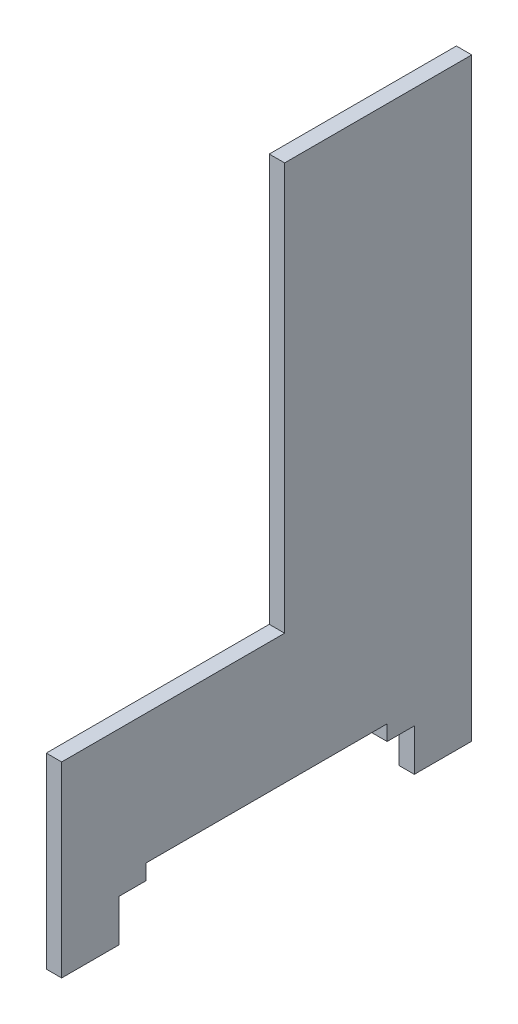
ISO-10303-21;
HEADER;
FILE_DESCRIPTION(('STEP AP214'),'2;1');
FILE_NAME('part.step','',(''),(''),'','','');
FILE_SCHEMA(('AUTOMOTIVE_DESIGN { 1 0 10303 214 1 1 1 1 }'));
ENDSEC;
DATA;
#1=APPLICATION_CONTEXT('core data for automotive mechanical design processes');
#2=APPLICATION_PROTOCOL_DEFINITION('international standard','automotive_design',2000,#1);
#3=PRODUCT_CONTEXT('',#1,'mechanical');
#4=PRODUCT('Part','Part','',(#3));
#5=PRODUCT_RELATED_PRODUCT_CATEGORY('part','',(#4));
#6=PRODUCT_DEFINITION_FORMATION('','',#4);
#7=PRODUCT_DEFINITION_CONTEXT('part definition',#1,'design');
#8=PRODUCT_DEFINITION('design','',#6,#7);
#9=PRODUCT_DEFINITION_SHAPE('','',#8);
#10=(LENGTH_UNIT() NAMED_UNIT(*) SI_UNIT(.MILLI.,.METRE.));
#11=(NAMED_UNIT(*) PLANE_ANGLE_UNIT() SI_UNIT($,.RADIAN.));
#12=(NAMED_UNIT(*) SI_UNIT($,.STERADIAN.) SOLID_ANGLE_UNIT());
#13=UNCERTAINTY_MEASURE_WITH_UNIT(LENGTH_MEASURE(1.E-05),#10,'distance_accuracy_value','');
#14=(GEOMETRIC_REPRESENTATION_CONTEXT(3) GLOBAL_UNCERTAINTY_ASSIGNED_CONTEXT((#13)) GLOBAL_UNIT_ASSIGNED_CONTEXT((#10,
#11,#12)) REPRESENTATION_CONTEXT('',''));
#15=CARTESIAN_POINT('',(0.,0.,0.));
#16=DIRECTION('',(0.,0.,1.));
#17=DIRECTION('',(1.,0.,0.));
#18=AXIS2_PLACEMENT_3D('',#15,#16,#17);
#19=CARTESIAN_POINT('',(-37.,119.507009142378,-3.49999999999999));
#20=DIRECTION('',(0.,-1.,0.));
#21=DIRECTION('',(0.,0.,-1.));
#22=AXIS2_PLACEMENT_3D('',#19,#20,#21);
#23=PLANE('',#22);
#24=DIRECTION('',(0.,0.,1.));
#25=VECTOR('',#24,1.);
#26=CARTESIAN_POINT('',(-40.,119.507009142378,-3.49999999999999));
#27=LINE('',#26,#25);
#28=CARTESIAN_POINT('',(-40.,119.507009142378,-40.));
#29=VERTEX_POINT('',#28);
#30=CARTESIAN_POINT('',(-40.,119.507009142378,-3.49999999999999));
#31=VERTEX_POINT('',#30);
#32=EDGE_CURVE('E165',#29,#31,#27,.T.);
#33=ORIENTED_EDGE('',*,*,#32,.T.);
#34=DIRECTION('',(-1.,0.,0.));
#35=VECTOR('',#34,1.);
#36=CARTESIAN_POINT('',(-37.,119.507009142378,-3.49999999999999));
#37=LINE('',#36,#35);
#38=CARTESIAN_POINT('',(-37.,119.507009142378,-3.49999999999999));
#39=VERTEX_POINT('',#38);
#40=EDGE_CURVE('E11',#39,#31,#37,.T.);
#41=ORIENTED_EDGE('',*,*,#40,.F.);
#42=DIRECTION('',(0.,0.,1.));
#43=VECTOR('',#42,1.);
#44=CARTESIAN_POINT('',(-37.,119.507009142378,-3.49999999999999));
#45=LINE('',#44,#43);
#46=CARTESIAN_POINT('',(-37.,119.507009142378,-40.));
#47=VERTEX_POINT('',#46);
#48=EDGE_CURVE('E191',#47,#39,#45,.T.);
#49=ORIENTED_EDGE('',*,*,#48,.F.);
#50=DIRECTION('',(-1.,0.,0.));
#51=VECTOR('',#50,1.);
#52=CARTESIAN_POINT('',(-37.,119.507009142378,-40.));
#53=LINE('',#52,#51);
#54=EDGE_CURVE('E161',#47,#29,#53,.T.);
#55=ORIENTED_EDGE('',*,*,#54,.T.);
#56=EDGE_LOOP('',(#33,#41,#49,#55));
#57=FACE_BOUND('',#56,.T.);
#58=ADVANCED_FACE('F33',(#57),#23,.F.);
#59=CARTESIAN_POINT('',(-37.,40.05,-3.49999999999999));
#60=DIRECTION('',(0.,0.,-1.));
#61=DIRECTION('',(0.,1.,0.));
#62=AXIS2_PLACEMENT_3D('',#59,#60,#61);
#63=PLANE('',#62);
#64=DIRECTION('',(0.,-1.,0.));
#65=VECTOR('',#64,1.);
#66=CARTESIAN_POINT('',(-40.,40.05,-3.49999999999999));
#67=LINE('',#66,#65);
#68=CARTESIAN_POINT('',(-40.,40.05,-3.49999999999999));
#69=VERTEX_POINT('',#68);
#70=EDGE_CURVE('E168',#31,#69,#67,.T.);
#71=ORIENTED_EDGE('',*,*,#70,.T.);
#72=DIRECTION('',(-1.,0.,0.));
#73=VECTOR('',#72,1.);
#74=CARTESIAN_POINT('',(-37.,40.05,-3.49999999999999));
#75=LINE('',#74,#73);
#76=CARTESIAN_POINT('',(-37.,40.05,-3.49999999999999));
#77=VERTEX_POINT('',#76);
#78=EDGE_CURVE('E41',#77,#69,#75,.T.);
#79=ORIENTED_EDGE('',*,*,#78,.F.);
#80=DIRECTION('',(0.,-1.,0.));
#81=VECTOR('',#80,1.);
#82=CARTESIAN_POINT('',(-37.,40.05,-3.49999999999999));
#83=LINE('',#82,#81);
#84=EDGE_CURVE('E110',#39,#77,#83,.T.);
#85=ORIENTED_EDGE('',*,*,#84,.F.);
#86=ORIENTED_EDGE('',*,*,#40,.T.);
#87=EDGE_LOOP('',(#71,#79,#85,#86));
#88=FACE_BOUND('',#87,.T.);
#89=ADVANCED_FACE('F279',(#88),#63,.F.);
#90=CARTESIAN_POINT('',(-37.,40.05,40.));
#91=DIRECTION('',(0.,-1.,0.));
#92=DIRECTION('',(0.,0.,-1.));
#93=AXIS2_PLACEMENT_3D('',#90,#91,#92);
#94=PLANE('',#93);
#95=DIRECTION('',(0.,0.,1.));
#96=VECTOR('',#95,1.);
#97=CARTESIAN_POINT('',(-40.,40.05,40.));
#98=LINE('',#97,#96);
#99=CARTESIAN_POINT('',(-40.,40.05,40.));
#100=VERTEX_POINT('',#99);
#101=EDGE_CURVE('E170',#69,#100,#98,.T.);
#102=ORIENTED_EDGE('',*,*,#101,.T.);
#103=DIRECTION('',(-1.,0.,0.));
#104=VECTOR('',#103,1.);
#105=CARTESIAN_POINT('',(-37.,40.05,40.));
#106=LINE('',#105,#104);
#107=CARTESIAN_POINT('',(-37.,40.05,40.));
#108=VERTEX_POINT('',#107);
#109=EDGE_CURVE('E216',#108,#100,#106,.T.);
#110=ORIENTED_EDGE('',*,*,#109,.F.);
#111=DIRECTION('',(0.,0.,1.));
#112=VECTOR('',#111,1.);
#113=CARTESIAN_POINT('',(-37.,40.05,40.));
#114=LINE('',#113,#112);
#115=EDGE_CURVE('E224',#77,#108,#114,.T.);
#116=ORIENTED_EDGE('',*,*,#115,.F.);
#117=ORIENTED_EDGE('',*,*,#78,.T.);
#118=EDGE_LOOP('',(#102,#110,#116,#117));
#119=FACE_BOUND('',#118,.T.);
#120=ADVANCED_FACE('F222',(#119),#94,.F.);
#121=CARTESIAN_POINT('',(-37.,3.55000000000003,40.));
#122=DIRECTION('',(0.,0.,-1.));
#123=DIRECTION('',(-1.,0.,0.));
#124=AXIS2_PLACEMENT_3D('',#121,#122,#123);
#125=PLANE('',#124);
#126=DIRECTION('',(0.,-1.,0.));
#127=VECTOR('',#126,1.);
#128=CARTESIAN_POINT('',(-40.,3.55000000000003,40.));
#129=LINE('',#128,#127);
#130=CARTESIAN_POINT('',(-40.,3.55000000000003,40.));
#131=VERTEX_POINT('',#130);
#132=EDGE_CURVE('E172',#100,#131,#129,.T.);
#133=ORIENTED_EDGE('',*,*,#132,.T.);
#134=DIRECTION('',(-1.,0.,0.));
#135=VECTOR('',#134,1.);
#136=CARTESIAN_POINT('',(-37.,3.55000000000003,40.));
#137=LINE('',#136,#135);
#138=CARTESIAN_POINT('',(-37.,3.55000000000003,40.));
#139=VERTEX_POINT('',#138);
#140=EDGE_CURVE('E213',#139,#131,#137,.T.);
#141=ORIENTED_EDGE('',*,*,#140,.F.);
#142=DIRECTION('',(0.,-1.,0.));
#143=VECTOR('',#142,1.);
#144=CARTESIAN_POINT('',(-37.,3.55000000000003,40.));
#145=LINE('',#144,#143);
#146=EDGE_CURVE('E242',#108,#139,#145,.T.);
#147=ORIENTED_EDGE('',*,*,#146,.F.);
#148=ORIENTED_EDGE('',*,*,#109,.T.);
#149=EDGE_LOOP('',(#133,#141,#147,#148));
#150=FACE_BOUND('',#149,.T.);
#151=ADVANCED_FACE('F233',(#150),#125,.F.);
#152=CARTESIAN_POINT('',(-37.,3.55000000000004,28.8));
#153=DIRECTION('',(0.,1.,0.));
#154=DIRECTION('',(0.,0.,1.));
#155=AXIS2_PLACEMENT_3D('',#152,#153,#154);
#156=PLANE('',#155);
#157=DIRECTION('',(0.,0.,-1.));
#158=VECTOR('',#157,1.);
#159=CARTESIAN_POINT('',(-40.,3.55000000000004,28.8));
#160=LINE('',#159,#158);
#161=CARTESIAN_POINT('',(-40.,3.55000000000004,28.8));
#162=VERTEX_POINT('',#161);
#163=EDGE_CURVE('E174',#131,#162,#160,.T.);
#164=ORIENTED_EDGE('',*,*,#163,.T.);
#165=DIRECTION('',(-1.,0.,0.));
#166=VECTOR('',#165,1.);
#167=CARTESIAN_POINT('',(-37.,3.55000000000004,28.8));
#168=LINE('',#167,#166);
#169=CARTESIAN_POINT('',(-37.,3.55000000000004,28.8));
#170=VERTEX_POINT('',#169);
#171=EDGE_CURVE('E210',#170,#162,#168,.T.);
#172=ORIENTED_EDGE('',*,*,#171,.F.);
#173=DIRECTION('',(0.,0.,-1.));
#174=VECTOR('',#173,1.);
#175=CARTESIAN_POINT('',(-37.,3.55000000000004,28.8));
#176=LINE('',#175,#174);
#177=EDGE_CURVE('E239',#139,#170,#176,.T.);
#178=ORIENTED_EDGE('',*,*,#177,.F.);
#179=ORIENTED_EDGE('',*,*,#140,.T.);
#180=EDGE_LOOP('',(#164,#172,#178,#179));
#181=FACE_BOUND('',#180,.T.);
#182=ADVANCED_FACE('F237',(#181),#156,.F.);
#183=CARTESIAN_POINT('',(-37.,11.75,28.8));
#184=DIRECTION('',(0.,0.,1.));
#185=DIRECTION('',(1.,0.,0.));
#186=AXIS2_PLACEMENT_3D('',#183,#184,#185);
#187=PLANE('',#186);
#188=DIRECTION('',(0.,1.,0.));
#189=VECTOR('',#188,1.);
#190=CARTESIAN_POINT('',(-40.,11.75,28.8));
#191=LINE('',#190,#189);
#192=CARTESIAN_POINT('',(-40.,11.75,28.8));
#193=VERTEX_POINT('',#192);
#194=EDGE_CURVE('E176',#162,#193,#191,.T.);
#195=ORIENTED_EDGE('',*,*,#194,.T.);
#196=DIRECTION('',(-1.,0.,0.));
#197=VECTOR('',#196,1.);
#198=CARTESIAN_POINT('',(-37.,11.75,28.8));
#199=LINE('',#198,#197);
#200=CARTESIAN_POINT('',(-37.,11.75,28.8));
#201=VERTEX_POINT('',#200);
#202=EDGE_CURVE('E207',#201,#193,#199,.T.);
#203=ORIENTED_EDGE('',*,*,#202,.F.);
#204=DIRECTION('',(0.,1.,0.));
#205=VECTOR('',#204,1.);
#206=CARTESIAN_POINT('',(-37.,11.75,28.8));
#207=LINE('',#206,#205);
#208=EDGE_CURVE('E241',#170,#201,#207,.T.);
#209=ORIENTED_EDGE('',*,*,#208,.F.);
#210=ORIENTED_EDGE('',*,*,#171,.T.);
#211=EDGE_LOOP('',(#195,#203,#209,#210));
#212=FACE_BOUND('',#211,.T.);
#213=ADVANCED_FACE('F292',(#212),#187,.F.);
#214=CARTESIAN_POINT('',(-37.,11.75,23.5));
#215=DIRECTION('',(0.,1.,0.));
#216=DIRECTION('',(0.,0.,1.));
#217=AXIS2_PLACEMENT_3D('',#214,#215,#216);
#218=PLANE('',#217);
#219=DIRECTION('',(0.,0.,-1.));
#220=VECTOR('',#219,1.);
#221=CARTESIAN_POINT('',(-40.,11.75,23.5));
#222=LINE('',#221,#220);
#223=CARTESIAN_POINT('',(-40.,11.75,23.5));
#224=VERTEX_POINT('',#223);
#225=EDGE_CURVE('E178',#193,#224,#222,.T.);
#226=ORIENTED_EDGE('',*,*,#225,.T.);
#227=DIRECTION('',(-1.,0.,0.));
#228=VECTOR('',#227,1.);
#229=CARTESIAN_POINT('',(-37.,11.75,23.5));
#230=LINE('',#229,#228);
#231=CARTESIAN_POINT('',(-37.,11.75,23.5));
#232=VERTEX_POINT('',#231);
#233=EDGE_CURVE('E204',#232,#224,#230,.T.);
#234=ORIENTED_EDGE('',*,*,#233,.F.);
#235=DIRECTION('',(0.,0.,-1.));
#236=VECTOR('',#235,1.);
#237=CARTESIAN_POINT('',(-37.,11.75,23.5));
#238=LINE('',#237,#236);
#239=EDGE_CURVE('E244',#201,#232,#238,.T.);
#240=ORIENTED_EDGE('',*,*,#239,.F.);
#241=ORIENTED_EDGE('',*,*,#202,.T.);
#242=EDGE_LOOP('',(#226,#234,#240,#241));
#243=FACE_BOUND('',#242,.T.);
#244=ADVANCED_FACE('F295',(#243),#218,.F.);
#245=CARTESIAN_POINT('',(-37.,14.75,23.5));
#246=DIRECTION('',(0.,0.,1.));
#247=DIRECTION('',(1.,0.,0.));
#248=AXIS2_PLACEMENT_3D('',#245,#246,#247);
#249=PLANE('',#248);
#250=DIRECTION('',(0.,1.,0.));
#251=VECTOR('',#250,1.);
#252=CARTESIAN_POINT('',(-40.,14.75,23.5));
#253=LINE('',#252,#251);
#254=CARTESIAN_POINT('',(-40.,14.75,23.5));
#255=VERTEX_POINT('',#254);
#256=EDGE_CURVE('E180',#224,#255,#253,.T.);
#257=ORIENTED_EDGE('',*,*,#256,.T.);
#258=DIRECTION('',(-1.,0.,0.));
#259=VECTOR('',#258,1.);
#260=CARTESIAN_POINT('',(-37.,14.75,23.5));
#261=LINE('',#260,#259);
#262=CARTESIAN_POINT('',(-37.,14.75,23.5));
#263=VERTEX_POINT('',#262);
#264=EDGE_CURVE('E201',#263,#255,#261,.T.);
#265=ORIENTED_EDGE('',*,*,#264,.F.);
#266=DIRECTION('',(0.,1.,0.));
#267=VECTOR('',#266,1.);
#268=CARTESIAN_POINT('',(-37.,14.75,23.5));
#269=LINE('',#268,#267);
#270=EDGE_CURVE('E250',#232,#263,#269,.T.);
#271=ORIENTED_EDGE('',*,*,#270,.F.);
#272=ORIENTED_EDGE('',*,*,#233,.T.);
#273=EDGE_LOOP('',(#257,#265,#271,#272));
#274=FACE_BOUND('',#273,.T.);
#275=ADVANCED_FACE('F299',(#274),#249,.F.);
#276=CARTESIAN_POINT('',(-37.,14.75,-23.5));
#277=DIRECTION('',(0.,1.,0.));
#278=DIRECTION('',(0.,0.,1.));
#279=AXIS2_PLACEMENT_3D('',#276,#277,#278);
#280=PLANE('',#279);
#281=DIRECTION('',(0.,0.,-1.));
#282=VECTOR('',#281,1.);
#283=CARTESIAN_POINT('',(-40.,14.75,-23.5));
#284=LINE('',#283,#282);
#285=CARTESIAN_POINT('',(-40.,14.75,-23.5));
#286=VERTEX_POINT('',#285);
#287=EDGE_CURVE('E182',#255,#286,#284,.T.);
#288=ORIENTED_EDGE('',*,*,#287,.T.);
#289=DIRECTION('',(-1.,0.,0.));
#290=VECTOR('',#289,1.);
#291=CARTESIAN_POINT('',(-37.,14.75,-23.5));
#292=LINE('',#291,#290);
#293=CARTESIAN_POINT('',(-37.,14.75,-23.5));
#294=VERTEX_POINT('',#293);
#295=EDGE_CURVE('E198',#294,#286,#292,.T.);
#296=ORIENTED_EDGE('',*,*,#295,.F.);
#297=DIRECTION('',(0.,0.,-1.));
#298=VECTOR('',#297,1.);
#299=CARTESIAN_POINT('',(-37.,14.75,-23.5));
#300=LINE('',#299,#298);
#301=EDGE_CURVE('E252',#263,#294,#300,.T.);
#302=ORIENTED_EDGE('',*,*,#301,.F.);
#303=ORIENTED_EDGE('',*,*,#264,.T.);
#304=EDGE_LOOP('',(#288,#296,#302,#303));
#305=FACE_BOUND('',#304,.T.);
#306=ADVANCED_FACE('F303',(#305),#280,.F.);
#307=CARTESIAN_POINT('',(-37.,11.75,-23.5));
#308=DIRECTION('',(0.,0.,-1.));
#309=DIRECTION('',(-1.,0.,0.));
#310=AXIS2_PLACEMENT_3D('',#307,#308,#309);
#311=PLANE('',#310);
#312=DIRECTION('',(0.,-1.,0.));
#313=VECTOR('',#312,1.);
#314=CARTESIAN_POINT('',(-40.,11.75,-23.5));
#315=LINE('',#314,#313);
#316=CARTESIAN_POINT('',(-40.,11.75,-23.5));
#317=VERTEX_POINT('',#316);
#318=EDGE_CURVE('E184',#286,#317,#315,.T.);
#319=ORIENTED_EDGE('',*,*,#318,.T.);
#320=DIRECTION('',(-1.,0.,0.));
#321=VECTOR('',#320,1.);
#322=CARTESIAN_POINT('',(-37.,11.75,-23.5));
#323=LINE('',#322,#321);
#324=CARTESIAN_POINT('',(-37.,11.75,-23.5));
#325=VERTEX_POINT('',#324);
#326=EDGE_CURVE('E195',#325,#317,#323,.T.);
#327=ORIENTED_EDGE('',*,*,#326,.F.);
#328=DIRECTION('',(0.,-1.,0.));
#329=VECTOR('',#328,1.);
#330=CARTESIAN_POINT('',(-37.,11.75,-23.5));
#331=LINE('',#330,#329);
#332=EDGE_CURVE('E254',#294,#325,#331,.T.);
#333=ORIENTED_EDGE('',*,*,#332,.F.);
#334=ORIENTED_EDGE('',*,*,#295,.T.);
#335=EDGE_LOOP('',(#319,#327,#333,#334));
#336=FACE_BOUND('',#335,.T.);
#337=ADVANCED_FACE('F260',(#336),#311,.F.);
#338=CARTESIAN_POINT('',(-37.,11.75,-28.8));
#339=DIRECTION('',(0.,1.,0.));
#340=DIRECTION('',(0.,0.,1.));
#341=AXIS2_PLACEMENT_3D('',#338,#339,#340);
#342=PLANE('',#341);
#343=DIRECTION('',(0.,0.,-1.));
#344=VECTOR('',#343,1.);
#345=CARTESIAN_POINT('',(-40.,11.75,-28.8));
#346=LINE('',#345,#344);
#347=CARTESIAN_POINT('',(-40.,11.75,-28.8));
#348=VERTEX_POINT('',#347);
#349=EDGE_CURVE('E186',#317,#348,#346,.T.);
#350=ORIENTED_EDGE('',*,*,#349,.T.);
#351=DIRECTION('',(-1.,0.,0.));
#352=VECTOR('',#351,1.);
#353=CARTESIAN_POINT('',(-37.,11.75,-28.8));
#354=LINE('',#353,#352);
#355=CARTESIAN_POINT('',(-37.,11.75,-28.8));
#356=VERTEX_POINT('',#355);
#357=EDGE_CURVE('E156',#356,#348,#354,.T.);
#358=ORIENTED_EDGE('',*,*,#357,.F.);
#359=DIRECTION('',(0.,0.,-1.));
#360=VECTOR('',#359,1.);
#361=CARTESIAN_POINT('',(-37.,11.75,-28.8));
#362=LINE('',#361,#360);
#363=EDGE_CURVE('E147',#325,#356,#362,.T.);
#364=ORIENTED_EDGE('',*,*,#363,.F.);
#365=ORIENTED_EDGE('',*,*,#326,.T.);
#366=EDGE_LOOP('',(#350,#358,#364,#365));
#367=FACE_BOUND('',#366,.T.);
#368=ADVANCED_FACE('F264',(#367),#342,.F.);
#369=CARTESIAN_POINT('',(-37.,3.55000000000003,-28.8));
#370=DIRECTION('',(0.,0.,-1.));
#371=DIRECTION('',(-1.,0.,0.));
#372=AXIS2_PLACEMENT_3D('',#369,#370,#371);
#373=PLANE('',#372);
#374=DIRECTION('',(0.,-1.,0.));
#375=VECTOR('',#374,1.);
#376=CARTESIAN_POINT('',(-40.,3.55000000000003,-28.8));
#377=LINE('',#376,#375);
#378=CARTESIAN_POINT('',(-40.,3.55000000000003,-28.8));
#379=VERTEX_POINT('',#378);
#380=EDGE_CURVE('E155',#348,#379,#377,.T.);
#381=ORIENTED_EDGE('',*,*,#380,.T.);
#382=DIRECTION('',(-1.,0.,0.));
#383=VECTOR('',#382,1.);
#384=CARTESIAN_POINT('',(-37.,3.55000000000003,-28.8));
#385=LINE('',#384,#383);
#386=CARTESIAN_POINT('',(-37.,3.55000000000003,-28.8));
#387=VERTEX_POINT('',#386);
#388=EDGE_CURVE('E152',#387,#379,#385,.T.);
#389=ORIENTED_EDGE('',*,*,#388,.F.);
#390=DIRECTION('',(0.,-1.,0.));
#391=VECTOR('',#390,1.);
#392=CARTESIAN_POINT('',(-37.,3.55000000000003,-28.8));
#393=LINE('',#392,#391);
#394=EDGE_CURVE('E141',#356,#387,#393,.T.);
#395=ORIENTED_EDGE('',*,*,#394,.F.);
#396=ORIENTED_EDGE('',*,*,#357,.T.);
#397=EDGE_LOOP('',(#381,#389,#395,#396));
#398=FACE_BOUND('',#397,.T.);
#399=ADVANCED_FACE('F153',(#398),#373,.F.);
#400=CARTESIAN_POINT('',(-37.,3.55000000000003,-40.));
#401=DIRECTION('',(0.,1.,0.));
#402=DIRECTION('',(0.,0.,1.));
#403=AXIS2_PLACEMENT_3D('',#400,#401,#402);
#404=PLANE('',#403);
#405=DIRECTION('',(0.,0.,-1.));
#406=VECTOR('',#405,1.);
#407=CARTESIAN_POINT('',(-40.,3.55000000000003,-40.));
#408=LINE('',#407,#406);
#409=CARTESIAN_POINT('',(-40.,3.55000000000003,-40.));
#410=VERTEX_POINT('',#409);
#411=EDGE_CURVE('E96',#379,#410,#408,.T.);
#412=ORIENTED_EDGE('',*,*,#411,.T.);
#413=DIRECTION('',(-1.,0.,0.));
#414=VECTOR('',#413,1.);
#415=CARTESIAN_POINT('',(-37.,3.55000000000003,-40.));
#416=LINE('',#415,#414);
#417=CARTESIAN_POINT('',(-37.,3.55000000000003,-40.));
#418=VERTEX_POINT('',#417);
#419=EDGE_CURVE('E157',#418,#410,#416,.T.);
#420=ORIENTED_EDGE('',*,*,#419,.F.);
#421=DIRECTION('',(0.,0.,-1.));
#422=VECTOR('',#421,1.);
#423=CARTESIAN_POINT('',(-37.,3.55000000000003,-40.));
#424=LINE('',#423,#422);
#425=EDGE_CURVE('E145',#387,#418,#424,.T.);
#426=ORIENTED_EDGE('',*,*,#425,.F.);
#427=ORIENTED_EDGE('',*,*,#388,.T.);
#428=EDGE_LOOP('',(#412,#420,#426,#427));
#429=FACE_BOUND('',#428,.T.);
#430=ADVANCED_FACE('F159',(#429),#404,.F.);
#431=CARTESIAN_POINT('',(-37.,119.507009142378,-40.));
#432=DIRECTION('',(0.,0.,1.));
#433=DIRECTION('',(0.,-1.,0.));
#434=AXIS2_PLACEMENT_3D('',#431,#432,#433);
#435=PLANE('',#434);
#436=DIRECTION('',(0.,1.,0.));
#437=VECTOR('',#436,1.);
#438=CARTESIAN_POINT('',(-40.,119.507009142378,-40.));
#439=LINE('',#438,#437);
#440=EDGE_CURVE('E102',#410,#29,#439,.T.);
#441=ORIENTED_EDGE('',*,*,#440,.T.);
#442=ORIENTED_EDGE('',*,*,#54,.F.);
#443=DIRECTION('',(0.,1.,0.));
#444=VECTOR('',#443,1.);
#445=CARTESIAN_POINT('',(-37.,119.507009142378,-40.));
#446=LINE('',#445,#444);
#447=EDGE_CURVE('E49',#418,#47,#446,.T.);
#448=ORIENTED_EDGE('',*,*,#447,.F.);
#449=ORIENTED_EDGE('',*,*,#419,.T.);
#450=EDGE_LOOP('',(#441,#442,#448,#449));
#451=FACE_BOUND('',#450,.T.);
#452=ADVANCED_FACE('F268',(#451),#435,.F.);
#453=CARTESIAN_POINT('',(-37.,0.,0.));
#454=DIRECTION('',(-1.,0.,0.));
#455=DIRECTION('',(0.,0.,1.));
#456=AXIS2_PLACEMENT_3D('',#453,#454,#455);
#457=PLANE('',#456);
#458=ORIENTED_EDGE('',*,*,#48,.T.);
#459=ORIENTED_EDGE('',*,*,#84,.T.);
#460=ORIENTED_EDGE('',*,*,#115,.T.);
#461=ORIENTED_EDGE('',*,*,#146,.T.);
#462=ORIENTED_EDGE('',*,*,#177,.T.);
#463=ORIENTED_EDGE('',*,*,#208,.T.);
#464=ORIENTED_EDGE('',*,*,#239,.T.);
#465=ORIENTED_EDGE('',*,*,#270,.T.);
#466=ORIENTED_EDGE('',*,*,#301,.T.);
#467=ORIENTED_EDGE('',*,*,#332,.T.);
#468=ORIENTED_EDGE('',*,*,#363,.T.);
#469=ORIENTED_EDGE('',*,*,#394,.T.);
#470=ORIENTED_EDGE('',*,*,#425,.T.);
#471=ORIENTED_EDGE('',*,*,#447,.T.);
#472=EDGE_LOOP('',(#458,#459,#460,#461,#462,#463,#464,#465,#466,#467,#468,#469,#470,#471));
#473=FACE_BOUND('',#472,.T.);
#474=ADVANCED_FACE('F143',(#473),#457,.F.);
#475=CARTESIAN_POINT('',(-40.,0.,0.));
#476=DIRECTION('',(-1.,0.,0.));
#477=DIRECTION('',(0.,0.,1.));
#478=AXIS2_PLACEMENT_3D('',#475,#476,#477);
#479=PLANE('',#478);
#480=ORIENTED_EDGE('',*,*,#32,.F.);
#481=ORIENTED_EDGE('',*,*,#440,.F.);
#482=ORIENTED_EDGE('',*,*,#411,.F.);
#483=ORIENTED_EDGE('',*,*,#380,.F.);
#484=ORIENTED_EDGE('',*,*,#349,.F.);
#485=ORIENTED_EDGE('',*,*,#318,.F.);
#486=ORIENTED_EDGE('',*,*,#287,.F.);
#487=ORIENTED_EDGE('',*,*,#256,.F.);
#488=ORIENTED_EDGE('',*,*,#225,.F.);
#489=ORIENTED_EDGE('',*,*,#194,.F.);
#490=ORIENTED_EDGE('',*,*,#163,.F.);
#491=ORIENTED_EDGE('',*,*,#132,.F.);
#492=ORIENTED_EDGE('',*,*,#101,.F.);
#493=ORIENTED_EDGE('',*,*,#70,.F.);
#494=EDGE_LOOP('',(#480,#481,#482,#483,#484,#485,#486,#487,#488,#489,#490,#491,#492,#493));
#495=FACE_BOUND('',#494,.T.);
#496=ADVANCED_FACE('F228',(#495),#479,.T.);
#497=CLOSED_SHELL('',(#58,#89,#120,#151,#182,#213,#244,#275,#306,#337,#368,#399,#430,#452,#474,#496));
#498=MANIFOLD_SOLID_BREP('B2',#497);
#499=ADVANCED_BREP_SHAPE_REPRESENTATION('',(#18,#498),#14);
#500=SHAPE_DEFINITION_REPRESENTATION(#9,#499);
ENDSEC;
END-ISO-10303-21;
